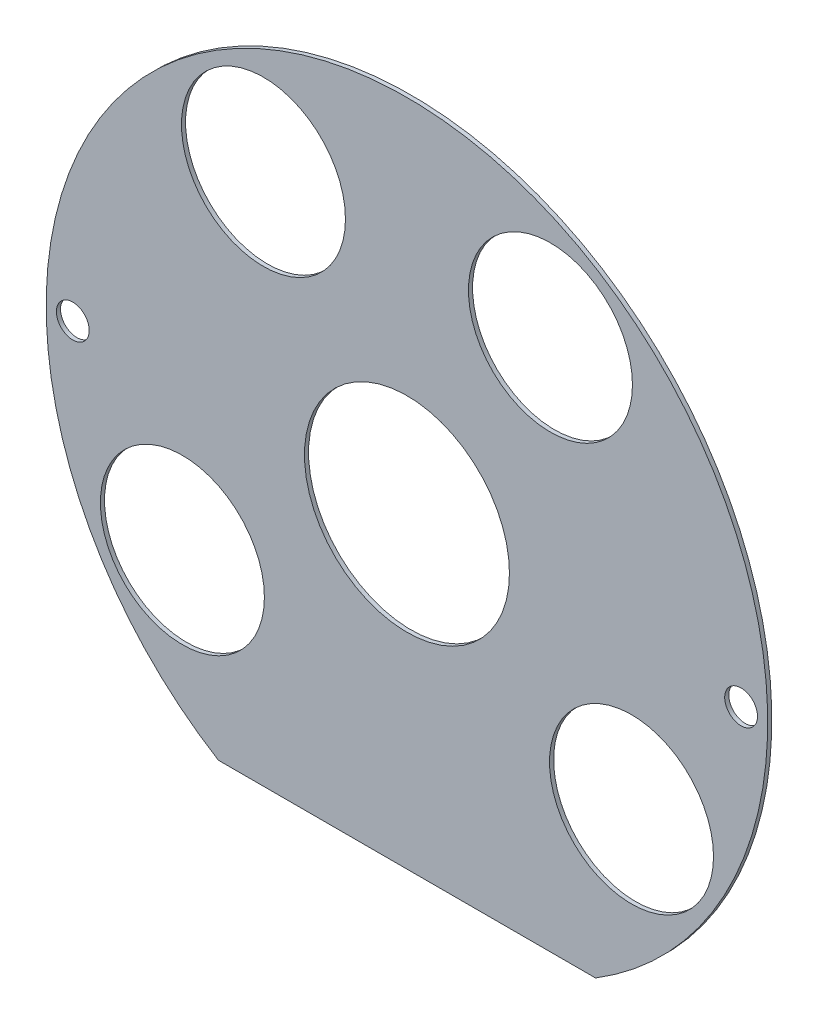
ISO-10303-21;
HEADER;
FILE_DESCRIPTION(('STEP AP214'),'2;1');
FILE_NAME('part.step','',(''),(''),'','','');
FILE_SCHEMA(('AUTOMOTIVE_DESIGN { 1 0 10303 214 1 1 1 1 }'));
ENDSEC;
DATA;
#1=APPLICATION_CONTEXT('core data for automotive mechanical design processes');
#2=APPLICATION_PROTOCOL_DEFINITION('international standard','automotive_design',2000,#1);
#3=PRODUCT_CONTEXT('',#1,'mechanical');
#4=PRODUCT('Part','Part','',(#3));
#5=PRODUCT_RELATED_PRODUCT_CATEGORY('part','',(#4));
#6=PRODUCT_DEFINITION_FORMATION('','',#4);
#7=PRODUCT_DEFINITION_CONTEXT('part definition',#1,'design');
#8=PRODUCT_DEFINITION('design','',#6,#7);
#9=PRODUCT_DEFINITION_SHAPE('','',#8);
#10=(LENGTH_UNIT() NAMED_UNIT(*) SI_UNIT(.MILLI.,.METRE.));
#11=(NAMED_UNIT(*) PLANE_ANGLE_UNIT() SI_UNIT($,.RADIAN.));
#12=(NAMED_UNIT(*) SI_UNIT($,.STERADIAN.) SOLID_ANGLE_UNIT());
#13=UNCERTAINTY_MEASURE_WITH_UNIT(LENGTH_MEASURE(1.E-05),#10,'distance_accuracy_value','');
#14=(GEOMETRIC_REPRESENTATION_CONTEXT(3) GLOBAL_UNCERTAINTY_ASSIGNED_CONTEXT((#13)) GLOBAL_UNIT_ASSIGNED_CONTEXT((#10,
#11,#12)) REPRESENTATION_CONTEXT('',''));
#15=CARTESIAN_POINT('',(0.,0.,0.));
#16=DIRECTION('',(0.,0.,1.));
#17=DIRECTION('',(1.,0.,0.));
#18=AXIS2_PLACEMENT_3D('',#15,#16,#17);
#19=CARTESIAN_POINT('',(0.,0.,1.));
#20=DIRECTION('',(0.,0.,1.));
#21=DIRECTION('',(1.,0.,0.));
#22=AXIS2_PLACEMENT_3D('',#19,#20,#21);
#23=PLANE('',#22);
#24=CARTESIAN_POINT('',(-81.4999999999993,1.18305896763121E-12,1.));
#25=DIRECTION('',(0.,0.,1.));
#26=DIRECTION('',(1.,0.,0.));
#27=AXIS2_PLACEMENT_3D('',#24,#25,#26);
#28=CIRCLE('',#27,4.00000000000001);
#29=CARTESIAN_POINT('',(-77.4999999999993,1.18305896763121E-12,1.));
#30=VERTEX_POINT('',#29);
#31=EDGE_CURVE('E111',#30,#30,#28,.T.);
#32=ORIENTED_EDGE('',*,*,#31,.F.);
#33=EDGE_LOOP('',(#32));
#34=FACE_BOUND('',#33,.T.);
#35=CARTESIAN_POINT('',(81.5000000000006,1.18302679367089E-12,1.));
#36=DIRECTION('',(0.,0.,1.));
#37=DIRECTION('',(1.,0.,0.));
#38=AXIS2_PLACEMENT_3D('',#35,#36,#37);
#39=CIRCLE('',#38,4.00000000000001);
#40=CARTESIAN_POINT('',(85.5000000000006,1.18302679367089E-12,1.));
#41=VERTEX_POINT('',#40);
#42=EDGE_CURVE('E105',#41,#41,#39,.T.);
#43=ORIENTED_EDGE('',*,*,#42,.F.);
#44=EDGE_LOOP('',(#43));
#45=FACE_BOUND('',#44,.T.);
#46=CARTESIAN_POINT('',(-54.772,-35.,1.));
#47=DIRECTION('',(0.,0.,1.));
#48=DIRECTION('',(1.,0.,0.));
#49=AXIS2_PLACEMENT_3D('',#46,#47,#48);
#50=CIRCLE('',#49,20.);
#51=CARTESIAN_POINT('',(-34.772,-35.,1.));
#52=VERTEX_POINT('',#51);
#53=EDGE_CURVE('E90',#52,#52,#50,.T.);
#54=ORIENTED_EDGE('',*,*,#53,.F.);
#55=EDGE_LOOP('',(#54));
#56=FACE_BOUND('',#55,.T.);
#57=CARTESIAN_POINT('',(-35.,54.772,1.));
#58=DIRECTION('',(0.,0.,1.));
#59=DIRECTION('',(1.,0.,0.));
#60=AXIS2_PLACEMENT_3D('',#57,#58,#59);
#61=CIRCLE('',#60,20.);
#62=CARTESIAN_POINT('',(-15.,54.772,1.));
#63=VERTEX_POINT('',#62);
#64=EDGE_CURVE('E79',#63,#63,#61,.T.);
#65=ORIENTED_EDGE('',*,*,#64,.F.);
#66=EDGE_LOOP('',(#65));
#67=FACE_BOUND('',#66,.T.);
#68=CARTESIAN_POINT('',(0.,0.,1.));
#69=DIRECTION('',(0.,0.,1.));
#70=DIRECTION('',(1.,0.,0.));
#71=AXIS2_PLACEMENT_3D('',#68,#69,#70);
#72=CIRCLE('',#71,88.);
#73=CARTESIAN_POINT('',(46.,-75.0199973340442,1.));
#74=VERTEX_POINT('',#73);
#75=CARTESIAN_POINT('',(-46.,-75.0199973340442,1.));
#76=VERTEX_POINT('',#75);
#77=EDGE_CURVE('E64',#74,#76,#72,.T.);
#78=ORIENTED_EDGE('',*,*,#77,.T.);
#79=DIRECTION('',(1.,0.,0.));
#80=VECTOR('',#79,1.);
#81=CARTESIAN_POINT('',(-46.,-75.0199973340442,1.));
#82=LINE('',#81,#80);
#83=EDGE_CURVE('E49',#76,#74,#82,.T.);
#84=ORIENTED_EDGE('',*,*,#83,.T.);
#85=EDGE_LOOP('',(#78,#84));
#86=FACE_BOUND('',#85,.T.);
#87=CARTESIAN_POINT('',(0.,0.,1.));
#88=DIRECTION('',(0.,0.,1.));
#89=DIRECTION('',(1.,0.,0.));
#90=AXIS2_PLACEMENT_3D('',#87,#88,#89);
#91=CIRCLE('',#90,25.);
#92=CARTESIAN_POINT('',(25.,0.,1.));
#93=VERTEX_POINT('',#92);
#94=EDGE_CURVE('E70',#93,#93,#91,.T.);
#95=ORIENTED_EDGE('',*,*,#94,.F.);
#96=EDGE_LOOP('',(#95));
#97=FACE_BOUND('',#96,.T.);
#98=CARTESIAN_POINT('',(35.,54.772,1.));
#99=DIRECTION('',(0.,0.,1.));
#100=DIRECTION('',(1.,0.,0.));
#101=AXIS2_PLACEMENT_3D('',#98,#99,#100);
#102=CIRCLE('',#101,20.);
#103=CARTESIAN_POINT('',(55.,54.772,1.));
#104=VERTEX_POINT('',#103);
#105=EDGE_CURVE('E84',#104,#104,#102,.T.);
#106=ORIENTED_EDGE('',*,*,#105,.F.);
#107=EDGE_LOOP('',(#106));
#108=FACE_BOUND('',#107,.T.);
#109=CARTESIAN_POINT('',(54.772,-35.,1.));
#110=DIRECTION('',(0.,0.,1.));
#111=DIRECTION('',(1.,0.,0.));
#112=AXIS2_PLACEMENT_3D('',#109,#110,#111);
#113=CIRCLE('',#112,20.);
#114=CARTESIAN_POINT('',(74.772,-35.,1.));
#115=VERTEX_POINT('',#114);
#116=EDGE_CURVE('E96',#115,#115,#113,.T.);
#117=ORIENTED_EDGE('',*,*,#116,.F.);
#118=EDGE_LOOP('',(#117));
#119=FACE_BOUND('',#118,.T.);
#120=ADVANCED_FACE('F33',(#34,#45,#56,#67,#86,#97,#108,#119),#23,.T.);
#121=CARTESIAN_POINT('',(0.,0.,0.));
#122=DIRECTION('',(0.,0.,1.));
#123=DIRECTION('',(1.,0.,0.));
#124=AXIS2_PLACEMENT_3D('',#121,#122,#123);
#125=PLANE('',#124);
#126=CARTESIAN_POINT('',(-81.4999999999993,1.18305896763121E-12,0.));
#127=DIRECTION('',(0.,0.,1.));
#128=DIRECTION('',(1.,0.,0.));
#129=AXIS2_PLACEMENT_3D('',#126,#127,#128);
#130=CIRCLE('',#129,4.00000000000001);
#131=CARTESIAN_POINT('',(-77.4999999999993,1.18305896763121E-12,0.));
#132=VERTEX_POINT('',#131);
#133=EDGE_CURVE('E108',#132,#132,#130,.T.);
#134=ORIENTED_EDGE('',*,*,#133,.T.);
#135=EDGE_LOOP('',(#134));
#136=FACE_BOUND('',#135,.T.);
#137=CARTESIAN_POINT('',(81.5000000000006,1.18302679367089E-12,0.));
#138=DIRECTION('',(0.,0.,1.));
#139=DIRECTION('',(1.,0.,0.));
#140=AXIS2_PLACEMENT_3D('',#137,#138,#139);
#141=CIRCLE('',#140,4.00000000000001);
#142=CARTESIAN_POINT('',(85.5000000000006,1.18302679367089E-12,0.));
#143=VERTEX_POINT('',#142);
#144=EDGE_CURVE('E102',#143,#143,#141,.T.);
#145=ORIENTED_EDGE('',*,*,#144,.T.);
#146=EDGE_LOOP('',(#145));
#147=FACE_BOUND('',#146,.T.);
#148=CARTESIAN_POINT('',(-54.772,-35.,0.));
#149=DIRECTION('',(0.,0.,1.));
#150=DIRECTION('',(1.,0.,0.));
#151=AXIS2_PLACEMENT_3D('',#148,#149,#150);
#152=CIRCLE('',#151,20.);
#153=CARTESIAN_POINT('',(-34.772,-35.,0.));
#154=VERTEX_POINT('',#153);
#155=EDGE_CURVE('E93',#154,#154,#152,.T.);
#156=ORIENTED_EDGE('',*,*,#155,.T.);
#157=EDGE_LOOP('',(#156));
#158=FACE_BOUND('',#157,.T.);
#159=CARTESIAN_POINT('',(-35.,54.772,0.));
#160=DIRECTION('',(0.,0.,1.));
#161=DIRECTION('',(1.,0.,0.));
#162=AXIS2_PLACEMENT_3D('',#159,#160,#161);
#163=CIRCLE('',#162,20.);
#164=CARTESIAN_POINT('',(-15.,54.772,0.));
#165=VERTEX_POINT('',#164);
#166=EDGE_CURVE('E81',#165,#165,#163,.T.);
#167=ORIENTED_EDGE('',*,*,#166,.T.);
#168=EDGE_LOOP('',(#167));
#169=FACE_BOUND('',#168,.T.);
#170=CARTESIAN_POINT('',(0.,0.,0.));
#171=DIRECTION('',(0.,0.,1.));
#172=DIRECTION('',(1.,0.,0.));
#173=AXIS2_PLACEMENT_3D('',#170,#171,#172);
#174=CIRCLE('',#173,88.);
#175=CARTESIAN_POINT('',(46.,-75.0199973340442,0.));
#176=VERTEX_POINT('',#175);
#177=CARTESIAN_POINT('',(-46.,-75.0199973340442,0.));
#178=VERTEX_POINT('',#177);
#179=EDGE_CURVE('E65',#176,#178,#174,.T.);
#180=ORIENTED_EDGE('',*,*,#179,.F.);
#181=DIRECTION('',(1.,0.,0.));
#182=VECTOR('',#181,1.);
#183=CARTESIAN_POINT('',(-46.,-75.0199973340442,0.));
#184=LINE('',#183,#182);
#185=EDGE_CURVE('E57',#178,#176,#184,.T.);
#186=ORIENTED_EDGE('',*,*,#185,.F.);
#187=EDGE_LOOP('',(#180,#186));
#188=FACE_BOUND('',#187,.T.);
#189=CARTESIAN_POINT('',(0.,0.,0.));
#190=DIRECTION('',(0.,0.,1.));
#191=DIRECTION('',(1.,0.,0.));
#192=AXIS2_PLACEMENT_3D('',#189,#190,#191);
#193=CIRCLE('',#192,25.);
#194=CARTESIAN_POINT('',(25.,0.,0.));
#195=VERTEX_POINT('',#194);
#196=EDGE_CURVE('E73',#195,#195,#193,.T.);
#197=ORIENTED_EDGE('',*,*,#196,.T.);
#198=EDGE_LOOP('',(#197));
#199=FACE_BOUND('',#198,.T.);
#200=CARTESIAN_POINT('',(35.,54.772,0.));
#201=DIRECTION('',(0.,0.,1.));
#202=DIRECTION('',(1.,0.,0.));
#203=AXIS2_PLACEMENT_3D('',#200,#201,#202);
#204=CIRCLE('',#203,20.);
#205=CARTESIAN_POINT('',(55.,54.772,0.));
#206=VERTEX_POINT('',#205);
#207=EDGE_CURVE('E87',#206,#206,#204,.T.);
#208=ORIENTED_EDGE('',*,*,#207,.T.);
#209=EDGE_LOOP('',(#208));
#210=FACE_BOUND('',#209,.T.);
#211=CARTESIAN_POINT('',(54.772,-35.,0.));
#212=DIRECTION('',(0.,0.,1.));
#213=DIRECTION('',(1.,0.,0.));
#214=AXIS2_PLACEMENT_3D('',#211,#212,#213);
#215=CIRCLE('',#214,20.);
#216=CARTESIAN_POINT('',(74.772,-35.,0.));
#217=VERTEX_POINT('',#216);
#218=EDGE_CURVE('E99',#217,#217,#215,.T.);
#219=ORIENTED_EDGE('',*,*,#218,.T.);
#220=EDGE_LOOP('',(#219));
#221=FACE_BOUND('',#220,.T.);
#222=ADVANCED_FACE('F68',(#136,#147,#158,#169,#188,#199,#210,#221),#125,.F.);
#223=CARTESIAN_POINT('',(0.,0.,1.));
#224=DIRECTION('',(0.,0.,-1.));
#225=DIRECTION('',(-1.,0.,0.));
#226=AXIS2_PLACEMENT_3D('',#223,#224,#225);
#227=CYLINDRICAL_SURFACE('',#226,88.);
#228=ORIENTED_EDGE('',*,*,#179,.T.);
#229=DIRECTION('',(0.,0.,-1.));
#230=VECTOR('',#229,1.);
#231=CARTESIAN_POINT('',(-46.,-75.0199973340442,1.));
#232=LINE('',#231,#230);
#233=EDGE_CURVE('E11',#76,#178,#232,.T.);
#234=ORIENTED_EDGE('',*,*,#233,.F.);
#235=ORIENTED_EDGE('',*,*,#77,.F.);
#236=DIRECTION('',(0.,0.,-1.));
#237=VECTOR('',#236,1.);
#238=CARTESIAN_POINT('',(46.,-75.0199973340442,1.));
#239=LINE('',#238,#237);
#240=EDGE_CURVE('E42',#74,#176,#239,.T.);
#241=ORIENTED_EDGE('',*,*,#240,.T.);
#242=EDGE_LOOP('',(#228,#234,#235,#241));
#243=FACE_BOUND('',#242,.T.);
#244=ADVANCED_FACE('F35',(#243),#227,.T.);
#245=CARTESIAN_POINT('',(-46.,-75.0199973340442,1.));
#246=DIRECTION('',(0.,1.,0.));
#247=DIRECTION('',(0.,0.,1.));
#248=AXIS2_PLACEMENT_3D('',#245,#246,#247);
#249=PLANE('',#248);
#250=ORIENTED_EDGE('',*,*,#185,.T.);
#251=ORIENTED_EDGE('',*,*,#240,.F.);
#252=ORIENTED_EDGE('',*,*,#83,.F.);
#253=ORIENTED_EDGE('',*,*,#233,.T.);
#254=EDGE_LOOP('',(#250,#251,#252,#253));
#255=FACE_BOUND('',#254,.T.);
#256=ADVANCED_FACE('F60',(#255),#249,.F.);
#257=CARTESIAN_POINT('',(0.,0.,1.));
#258=DIRECTION('',(0.,0.,-1.));
#259=DIRECTION('',(-1.,0.,0.));
#260=AXIS2_PLACEMENT_3D('',#257,#258,#259);
#261=CYLINDRICAL_SURFACE('',#260,25.);
#262=ORIENTED_EDGE('',*,*,#94,.T.);
#263=EDGE_LOOP('',(#262));
#264=FACE_BOUND('',#263,.T.);
#265=ORIENTED_EDGE('',*,*,#196,.F.);
#266=EDGE_LOOP('',(#265));
#267=FACE_BOUND('',#266,.T.);
#268=ADVANCED_FACE('F155',(#264,#267),#261,.F.);
#269=CARTESIAN_POINT('',(-35.,54.772,1.));
#270=DIRECTION('',(0.,0.,-1.));
#271=DIRECTION('',(-1.,0.,0.));
#272=AXIS2_PLACEMENT_3D('',#269,#270,#271);
#273=CYLINDRICAL_SURFACE('',#272,20.);
#274=ORIENTED_EDGE('',*,*,#64,.T.);
#275=EDGE_LOOP('',(#274));
#276=FACE_BOUND('',#275,.T.);
#277=ORIENTED_EDGE('',*,*,#166,.F.);
#278=EDGE_LOOP('',(#277));
#279=FACE_BOUND('',#278,.T.);
#280=ADVANCED_FACE('F159',(#276,#279),#273,.F.);
#281=CARTESIAN_POINT('',(35.,54.772,1.));
#282=DIRECTION('',(0.,0.,-1.));
#283=DIRECTION('',(-1.,0.,0.));
#284=AXIS2_PLACEMENT_3D('',#281,#282,#283);
#285=CYLINDRICAL_SURFACE('',#284,20.);
#286=ORIENTED_EDGE('',*,*,#105,.T.);
#287=EDGE_LOOP('',(#286));
#288=FACE_BOUND('',#287,.T.);
#289=ORIENTED_EDGE('',*,*,#207,.F.);
#290=EDGE_LOOP('',(#289));
#291=FACE_BOUND('',#290,.T.);
#292=ADVANCED_FACE('F164',(#288,#291),#285,.F.);
#293=CARTESIAN_POINT('',(-54.772,-35.,1.));
#294=DIRECTION('',(0.,0.,-1.));
#295=DIRECTION('',(-1.,0.,0.));
#296=AXIS2_PLACEMENT_3D('',#293,#294,#295);
#297=CYLINDRICAL_SURFACE('',#296,20.);
#298=ORIENTED_EDGE('',*,*,#53,.T.);
#299=EDGE_LOOP('',(#298));
#300=FACE_BOUND('',#299,.T.);
#301=ORIENTED_EDGE('',*,*,#155,.F.);
#302=EDGE_LOOP('',(#301));
#303=FACE_BOUND('',#302,.T.);
#304=ADVANCED_FACE('F144',(#300,#303),#297,.F.);
#305=CARTESIAN_POINT('',(54.772,-35.,1.));
#306=DIRECTION('',(0.,0.,-1.));
#307=DIRECTION('',(-1.,0.,0.));
#308=AXIS2_PLACEMENT_3D('',#305,#306,#307);
#309=CYLINDRICAL_SURFACE('',#308,20.);
#310=ORIENTED_EDGE('',*,*,#116,.T.);
#311=EDGE_LOOP('',(#310));
#312=FACE_BOUND('',#311,.T.);
#313=ORIENTED_EDGE('',*,*,#218,.F.);
#314=EDGE_LOOP('',(#313));
#315=FACE_BOUND('',#314,.T.);
#316=ADVANCED_FACE('F141',(#312,#315),#309,.F.);
#317=CARTESIAN_POINT('',(81.5000000000006,1.18302679367089E-12,0.));
#318=DIRECTION('',(0.,0.,1.));
#319=DIRECTION('',(1.,0.,0.));
#320=AXIS2_PLACEMENT_3D('',#317,#318,#319);
#321=CYLINDRICAL_SURFACE('',#320,4.00000000000001);
#322=ORIENTED_EDGE('',*,*,#144,.F.);
#323=EDGE_LOOP('',(#322));
#324=FACE_BOUND('',#323,.T.);
#325=ORIENTED_EDGE('',*,*,#42,.T.);
#326=EDGE_LOOP('',(#325));
#327=FACE_BOUND('',#326,.T.);
#328=ADVANCED_FACE('F122',(#324,#327),#321,.F.);
#329=CARTESIAN_POINT('',(-81.4999999999993,1.18305896763121E-12,0.));
#330=DIRECTION('',(0.,0.,1.));
#331=DIRECTION('',(1.,0.,0.));
#332=AXIS2_PLACEMENT_3D('',#329,#330,#331);
#333=CYLINDRICAL_SURFACE('',#332,4.00000000000001);
#334=ORIENTED_EDGE('',*,*,#133,.F.);
#335=EDGE_LOOP('',(#334));
#336=FACE_BOUND('',#335,.T.);
#337=ORIENTED_EDGE('',*,*,#31,.T.);
#338=EDGE_LOOP('',(#337));
#339=FACE_BOUND('',#338,.T.);
#340=ADVANCED_FACE('F119',(#336,#339),#333,.F.);
#341=CLOSED_SHELL('',(#120,#222,#244,#256,#268,#280,#292,#304,#316,#328,#340));
#342=MANIFOLD_SOLID_BREP('B2',#341);
#343=ADVANCED_BREP_SHAPE_REPRESENTATION('',(#18,#342),#14);
#344=SHAPE_DEFINITION_REPRESENTATION(#9,#343);
ENDSEC;
END-ISO-10303-21;
